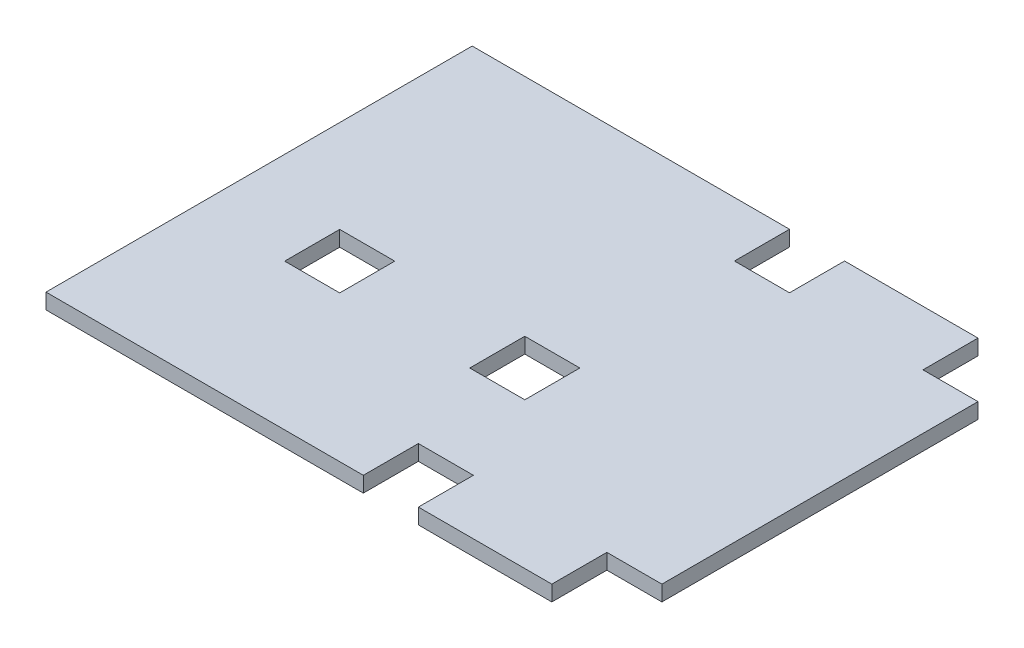
ISO-10303-21;
HEADER;
FILE_DESCRIPTION(('STEP AP214'),'2;1');
FILE_NAME('part.step','',(''),(''),'','','');
FILE_SCHEMA(('AUTOMOTIVE_DESIGN { 1 0 10303 214 1 1 1 1 }'));
ENDSEC;
DATA;
#1=APPLICATION_CONTEXT('core data for automotive mechanical design processes');
#2=APPLICATION_PROTOCOL_DEFINITION('international standard','automotive_design',2000,#1);
#3=PRODUCT_CONTEXT('',#1,'mechanical');
#4=PRODUCT('Part','Part','',(#3));
#5=PRODUCT_RELATED_PRODUCT_CATEGORY('part','',(#4));
#6=PRODUCT_DEFINITION_FORMATION('','',#4);
#7=PRODUCT_DEFINITION_CONTEXT('part definition',#1,'design');
#8=PRODUCT_DEFINITION('design','',#6,#7);
#9=PRODUCT_DEFINITION_SHAPE('','',#8);
#10=(LENGTH_UNIT() NAMED_UNIT(*) SI_UNIT(.MILLI.,.METRE.));
#11=(NAMED_UNIT(*) PLANE_ANGLE_UNIT() SI_UNIT($,.RADIAN.));
#12=(NAMED_UNIT(*) SI_UNIT($,.STERADIAN.) SOLID_ANGLE_UNIT());
#13=UNCERTAINTY_MEASURE_WITH_UNIT(LENGTH_MEASURE(1.E-05),#10,'distance_accuracy_value','');
#14=(GEOMETRIC_REPRESENTATION_CONTEXT(3) GLOBAL_UNCERTAINTY_ASSIGNED_CONTEXT((#13)) GLOBAL_UNIT_ASSIGNED_CONTEXT((#10,
#11,#12)) REPRESENTATION_CONTEXT('',''));
#15=CARTESIAN_POINT('',(0.,0.,0.));
#16=DIRECTION('',(0.,0.,1.));
#17=DIRECTION('',(1.,0.,0.));
#18=AXIS2_PLACEMENT_3D('',#15,#16,#17);
#19=CARTESIAN_POINT('',(-192.3,6.35,2.36168017295816E-13));
#20=DIRECTION('',(1.,0.,0.));
#21=DIRECTION('',(0.,0.,-1.));
#22=AXIS2_PLACEMENT_3D('',#19,#20,#21);
#23=PLANE('',#22);
#24=DIRECTION('',(0.,0.,1.));
#25=VECTOR('',#24,1.);
#26=CARTESIAN_POINT('',(-192.3,0.,2.36168017295816E-13));
#27=LINE('',#26,#25);
#28=CARTESIAN_POINT('',(-192.3,0.,92.4));
#29=VERTEX_POINT('',#28);
#30=CARTESIAN_POINT('',(-192.3,0.,115.));
#31=VERTEX_POINT('',#30);
#32=EDGE_CURVE('E289',#29,#31,#27,.T.);
#33=ORIENTED_EDGE('',*,*,#32,.F.);
#34=DIRECTION('',(0.,-1.,0.));
#35=VECTOR('',#34,1.);
#36=CARTESIAN_POINT('',(-192.3,6.35,92.4));
#37=LINE('',#36,#35);
#38=CARTESIAN_POINT('',(-192.3,6.35,92.4));
#39=VERTEX_POINT('',#38);
#40=EDGE_CURVE('E11',#39,#29,#37,.T.);
#41=ORIENTED_EDGE('',*,*,#40,.F.);
#42=DIRECTION('',(0.,0.,1.));
#43=VECTOR('',#42,1.);
#44=CARTESIAN_POINT('',(-192.3,6.35,2.36168017295816E-13));
#45=LINE('',#44,#43);
#46=CARTESIAN_POINT('',(-192.3,6.35,115.));
#47=VERTEX_POINT('',#46);
#48=EDGE_CURVE('E226',#39,#47,#45,.T.);
#49=ORIENTED_EDGE('',*,*,#48,.T.);
#50=DIRECTION('',(0.,-1.,0.));
#51=VECTOR('',#50,1.);
#52=CARTESIAN_POINT('',(-192.3,6.35,115.));
#53=LINE('',#52,#51);
#54=EDGE_CURVE('E140',#47,#31,#53,.T.);
#55=ORIENTED_EDGE('',*,*,#54,.T.);
#56=EDGE_LOOP('',(#33,#41,#49,#55));
#57=FACE_BOUND('',#56,.T.);
#58=ADVANCED_FACE('F38',(#57),#23,.T.);
#59=CARTESIAN_POINT('',(0.,6.35,92.4));
#60=DIRECTION('',(0.,0.,1.));
#61=DIRECTION('',(1.,0.,0.));
#62=AXIS2_PLACEMENT_3D('',#59,#60,#61);
#63=PLANE('',#62);
#64=DIRECTION('',(-1.,0.,0.));
#65=VECTOR('',#64,1.);
#66=CARTESIAN_POINT('',(0.,0.,92.4));
#67=LINE('',#66,#65);
#68=CARTESIAN_POINT('',(-169.7,0.,92.4));
#69=VERTEX_POINT('',#68);
#70=EDGE_CURVE('E216',#69,#29,#67,.T.);
#71=ORIENTED_EDGE('',*,*,#70,.F.);
#72=DIRECTION('',(0.,-1.,0.));
#73=VECTOR('',#72,1.);
#74=CARTESIAN_POINT('',(-169.7,6.35,92.4));
#75=LINE('',#74,#73);
#76=CARTESIAN_POINT('',(-169.7,6.35,92.4));
#77=VERTEX_POINT('',#76);
#78=EDGE_CURVE('E48',#77,#69,#75,.T.);
#79=ORIENTED_EDGE('',*,*,#78,.F.);
#80=DIRECTION('',(-1.,0.,0.));
#81=VECTOR('',#80,1.);
#82=CARTESIAN_POINT('',(0.,6.35,92.4));
#83=LINE('',#82,#81);
#84=EDGE_CURVE('E214',#77,#39,#83,.T.);
#85=ORIENTED_EDGE('',*,*,#84,.T.);
#86=ORIENTED_EDGE('',*,*,#40,.T.);
#87=EDGE_LOOP('',(#71,#79,#85,#86));
#88=FACE_BOUND('',#87,.T.);
#89=ADVANCED_FACE('F212',(#88),#63,.T.);
#90=CARTESIAN_POINT('',(-169.7,6.35,0.));
#91=DIRECTION('',(1.,0.,0.));
#92=DIRECTION('',(0.,0.,-1.));
#93=AXIS2_PLACEMENT_3D('',#90,#91,#92);
#94=PLANE('',#93);
#95=DIRECTION('',(0.,0.,1.));
#96=VECTOR('',#95,1.);
#97=CARTESIAN_POINT('',(-169.7,0.,0.));
#98=LINE('',#97,#96);
#99=CARTESIAN_POINT('',(-169.7,0.,115.));
#100=VERTEX_POINT('',#99);
#101=EDGE_CURVE('E292',#69,#100,#98,.T.);
#102=ORIENTED_EDGE('',*,*,#101,.T.);
#103=DIRECTION('',(0.,-1.,0.));
#104=VECTOR('',#103,1.);
#105=CARTESIAN_POINT('',(-169.7,6.35,115.));
#106=LINE('',#105,#104);
#107=CARTESIAN_POINT('',(-169.7,6.35,115.));
#108=VERTEX_POINT('',#107);
#109=EDGE_CURVE('E219',#108,#100,#106,.T.);
#110=ORIENTED_EDGE('',*,*,#109,.F.);
#111=DIRECTION('',(0.,0.,1.));
#112=VECTOR('',#111,1.);
#113=CARTESIAN_POINT('',(-169.7,6.35,0.));
#114=LINE('',#113,#112);
#115=EDGE_CURVE('E222',#77,#108,#114,.T.);
#116=ORIENTED_EDGE('',*,*,#115,.F.);
#117=ORIENTED_EDGE('',*,*,#78,.T.);
#118=EDGE_LOOP('',(#102,#110,#116,#117));
#119=FACE_BOUND('',#118,.T.);
#120=ADVANCED_FACE('F223',(#119),#94,.F.);
#121=CARTESIAN_POINT('',(-100.,6.35,0.));
#122=DIRECTION('',(1.,0.,0.));
#123=DIRECTION('',(0.,0.,-1.));
#124=AXIS2_PLACEMENT_3D('',#121,#122,#123);
#125=PLANE('',#124);
#126=DIRECTION('',(0.,0.,1.));
#127=VECTOR('',#126,1.);
#128=CARTESIAN_POINT('',(-100.,0.,0.));
#129=LINE('',#128,#127);
#130=CARTESIAN_POINT('',(-100.,0.,0.));
#131=VERTEX_POINT('',#130);
#132=CARTESIAN_POINT('',(-100.,0.,22.6));
#133=VERTEX_POINT('',#132);
#134=EDGE_CURVE('E245',#131,#133,#129,.T.);
#135=ORIENTED_EDGE('',*,*,#134,.F.);
#136=DIRECTION('',(0.,-1.,0.));
#137=VECTOR('',#136,1.);
#138=CARTESIAN_POINT('',(-100.,6.35,0.));
#139=LINE('',#138,#137);
#140=CARTESIAN_POINT('',(-100.,6.35,0.));
#141=VERTEX_POINT('',#140);
#142=EDGE_CURVE('E297',#141,#131,#139,.T.);
#143=ORIENTED_EDGE('',*,*,#142,.F.);
#144=DIRECTION('',(0.,0.,1.));
#145=VECTOR('',#144,1.);
#146=CARTESIAN_POINT('',(-100.,6.35,0.));
#147=LINE('',#146,#145);
#148=CARTESIAN_POINT('',(-100.,6.35,22.6));
#149=VERTEX_POINT('',#148);
#150=EDGE_CURVE('E358',#141,#149,#147,.T.);
#151=ORIENTED_EDGE('',*,*,#150,.T.);
#152=DIRECTION('',(0.,-1.,0.));
#153=VECTOR('',#152,1.);
#154=CARTESIAN_POINT('',(-100.,6.35,22.6));
#155=LINE('',#154,#153);
#156=EDGE_CURVE('E299',#149,#133,#155,.T.);
#157=ORIENTED_EDGE('',*,*,#156,.T.);
#158=EDGE_LOOP('',(#135,#143,#151,#157));
#159=FACE_BOUND('',#158,.T.);
#160=ADVANCED_FACE('F412',(#159),#125,.T.);
#161=CARTESIAN_POINT('',(0.,6.35,0.));
#162=DIRECTION('',(0.,0.,-1.));
#163=DIRECTION('',(-1.,0.,0.));
#164=AXIS2_PLACEMENT_3D('',#161,#162,#163);
#165=PLANE('',#164);
#166=DIRECTION('',(1.,0.,0.));
#167=VECTOR('',#166,1.);
#168=CARTESIAN_POINT('',(0.,0.,0.));
#169=LINE('',#168,#167);
#170=CARTESIAN_POINT('',(-230.3,0.,0.));
#171=VERTEX_POINT('',#170);
#172=EDGE_CURVE('E248',#171,#131,#169,.T.);
#173=ORIENTED_EDGE('',*,*,#172,.F.);
#174=DIRECTION('',(0.,-1.,0.));
#175=VECTOR('',#174,1.);
#176=CARTESIAN_POINT('',(-230.3,6.35,0.));
#177=LINE('',#176,#175);
#178=CARTESIAN_POINT('',(-230.3,6.35,0.));
#179=VERTEX_POINT('',#178);
#180=EDGE_CURVE('E330',#179,#171,#177,.T.);
#181=ORIENTED_EDGE('',*,*,#180,.F.);
#182=DIRECTION('',(1.,0.,0.));
#183=VECTOR('',#182,1.);
#184=CARTESIAN_POINT('',(0.,6.35,0.));
#185=LINE('',#184,#183);
#186=EDGE_CURVE('E362',#179,#141,#185,.T.);
#187=ORIENTED_EDGE('',*,*,#186,.T.);
#188=ORIENTED_EDGE('',*,*,#142,.T.);
#189=EDGE_LOOP('',(#173,#181,#187,#188));
#190=FACE_BOUND('',#189,.T.);
#191=ADVANCED_FACE('F415',(#190),#165,.T.);
#192=CARTESIAN_POINT('',(-230.3,6.35,0.));
#193=DIRECTION('',(1.,0.,0.));
#194=DIRECTION('',(0.,0.,-1.));
#195=AXIS2_PLACEMENT_3D('',#192,#193,#194);
#196=PLANE('',#195);
#197=DIRECTION('',(0.,0.,1.));
#198=VECTOR('',#197,1.);
#199=CARTESIAN_POINT('',(-230.3,0.,0.));
#200=LINE('',#199,#198);
#201=CARTESIAN_POINT('',(-230.3,0.,175.));
#202=VERTEX_POINT('',#201);
#203=EDGE_CURVE('E251',#171,#202,#200,.T.);
#204=ORIENTED_EDGE('',*,*,#203,.T.);
#205=DIRECTION('',(0.,-1.,0.));
#206=VECTOR('',#205,1.);
#207=CARTESIAN_POINT('',(-230.3,6.35,175.));
#208=LINE('',#207,#206);
#209=CARTESIAN_POINT('',(-230.3,6.35,175.));
#210=VERTEX_POINT('',#209);
#211=EDGE_CURVE('E327',#210,#202,#208,.T.);
#212=ORIENTED_EDGE('',*,*,#211,.F.);
#213=DIRECTION('',(0.,0.,1.));
#214=VECTOR('',#213,1.);
#215=CARTESIAN_POINT('',(-230.3,6.35,0.));
#216=LINE('',#215,#214);
#217=EDGE_CURVE('E369',#179,#210,#216,.T.);
#218=ORIENTED_EDGE('',*,*,#217,.F.);
#219=ORIENTED_EDGE('',*,*,#180,.T.);
#220=EDGE_LOOP('',(#204,#212,#218,#219));
#221=FACE_BOUND('',#220,.T.);
#222=ADVANCED_FACE('F421',(#221),#196,.F.);
#223=CARTESIAN_POINT('',(0.,6.35,175.));
#224=DIRECTION('',(0.,0.,-1.));
#225=DIRECTION('',(-1.,0.,0.));
#226=AXIS2_PLACEMENT_3D('',#223,#224,#225);
#227=PLANE('',#226);
#228=DIRECTION('',(1.,0.,0.));
#229=VECTOR('',#228,1.);
#230=CARTESIAN_POINT('',(0.,0.,175.));
#231=LINE('',#230,#229);
#232=CARTESIAN_POINT('',(-100.,0.,175.));
#233=VERTEX_POINT('',#232);
#234=EDGE_CURVE('E255',#202,#233,#231,.T.);
#235=ORIENTED_EDGE('',*,*,#234,.T.);
#236=DIRECTION('',(0.,-1.,0.));
#237=VECTOR('',#236,1.);
#238=CARTESIAN_POINT('',(-100.,6.35,175.));
#239=LINE('',#238,#237);
#240=CARTESIAN_POINT('',(-100.,6.35,175.));
#241=VERTEX_POINT('',#240);
#242=EDGE_CURVE('E325',#241,#233,#239,.T.);
#243=ORIENTED_EDGE('',*,*,#242,.F.);
#244=DIRECTION('',(1.,0.,0.));
#245=VECTOR('',#244,1.);
#246=CARTESIAN_POINT('',(0.,6.35,175.));
#247=LINE('',#246,#245);
#248=EDGE_CURVE('E373',#210,#241,#247,.T.);
#249=ORIENTED_EDGE('',*,*,#248,.F.);
#250=ORIENTED_EDGE('',*,*,#211,.T.);
#251=EDGE_LOOP('',(#235,#243,#249,#250));
#252=FACE_BOUND('',#251,.T.);
#253=ADVANCED_FACE('F424',(#252),#227,.F.);
#254=CARTESIAN_POINT('',(-100.,6.35,0.));
#255=DIRECTION('',(1.,0.,0.));
#256=DIRECTION('',(0.,0.,-1.));
#257=AXIS2_PLACEMENT_3D('',#254,#255,#256);
#258=PLANE('',#257);
#259=DIRECTION('',(0.,0.,1.));
#260=VECTOR('',#259,1.);
#261=CARTESIAN_POINT('',(-100.,0.,0.));
#262=LINE('',#261,#260);
#263=CARTESIAN_POINT('',(-100.,0.,152.4));
#264=VERTEX_POINT('',#263);
#265=EDGE_CURVE('E258',#264,#233,#262,.T.);
#266=ORIENTED_EDGE('',*,*,#265,.F.);
#267=DIRECTION('',(0.,-1.,0.));
#268=VECTOR('',#267,1.);
#269=CARTESIAN_POINT('',(-100.,6.35,152.4));
#270=LINE('',#269,#268);
#271=CARTESIAN_POINT('',(-100.,6.35,152.4));
#272=VERTEX_POINT('',#271);
#273=EDGE_CURVE('E323',#272,#264,#270,.T.);
#274=ORIENTED_EDGE('',*,*,#273,.F.);
#275=DIRECTION('',(0.,0.,1.));
#276=VECTOR('',#275,1.);
#277=CARTESIAN_POINT('',(-100.,6.35,0.));
#278=LINE('',#277,#276);
#279=EDGE_CURVE('E375',#272,#241,#278,.T.);
#280=ORIENTED_EDGE('',*,*,#279,.T.);
#281=ORIENTED_EDGE('',*,*,#242,.T.);
#282=EDGE_LOOP('',(#266,#274,#280,#281));
#283=FACE_BOUND('',#282,.T.);
#284=ADVANCED_FACE('F427',(#283),#258,.T.);
#285=CARTESIAN_POINT('',(0.,6.35,152.4));
#286=DIRECTION('',(0.,0.,1.));
#287=DIRECTION('',(1.,0.,0.));
#288=AXIS2_PLACEMENT_3D('',#285,#286,#287);
#289=PLANE('',#288);
#290=DIRECTION('',(-1.,0.,0.));
#291=VECTOR('',#290,1.);
#292=CARTESIAN_POINT('',(0.,0.,152.4));
#293=LINE('',#292,#291);
#294=CARTESIAN_POINT('',(-77.4,0.,152.4));
#295=VERTEX_POINT('',#294);
#296=EDGE_CURVE('E262',#295,#264,#293,.T.);
#297=ORIENTED_EDGE('',*,*,#296,.F.);
#298=DIRECTION('',(0.,-1.,0.));
#299=VECTOR('',#298,1.);
#300=CARTESIAN_POINT('',(-77.4,6.35,152.4));
#301=LINE('',#300,#299);
#302=CARTESIAN_POINT('',(-77.4,6.35,152.4));
#303=VERTEX_POINT('',#302);
#304=EDGE_CURVE('E321',#303,#295,#301,.T.);
#305=ORIENTED_EDGE('',*,*,#304,.F.);
#306=DIRECTION('',(-1.,0.,0.));
#307=VECTOR('',#306,1.);
#308=CARTESIAN_POINT('',(0.,6.35,152.4));
#309=LINE('',#308,#307);
#310=EDGE_CURVE('E379',#303,#272,#309,.T.);
#311=ORIENTED_EDGE('',*,*,#310,.T.);
#312=ORIENTED_EDGE('',*,*,#273,.T.);
#313=EDGE_LOOP('',(#297,#305,#311,#312));
#314=FACE_BOUND('',#313,.T.);
#315=ADVANCED_FACE('F431',(#314),#289,.T.);
#316=CARTESIAN_POINT('',(-77.4,6.35,0.));
#317=DIRECTION('',(1.,0.,0.));
#318=DIRECTION('',(0.,0.,-1.));
#319=AXIS2_PLACEMENT_3D('',#316,#317,#318);
#320=PLANE('',#319);
#321=DIRECTION('',(0.,0.,1.));
#322=VECTOR('',#321,1.);
#323=CARTESIAN_POINT('',(-77.4,0.,0.));
#324=LINE('',#323,#322);
#325=CARTESIAN_POINT('',(-77.4,0.,175.));
#326=VERTEX_POINT('',#325);
#327=EDGE_CURVE('E265',#295,#326,#324,.T.);
#328=ORIENTED_EDGE('',*,*,#327,.T.);
#329=DIRECTION('',(0.,-1.,0.));
#330=VECTOR('',#329,1.);
#331=CARTESIAN_POINT('',(-77.4,6.35,175.));
#332=LINE('',#331,#330);
#333=CARTESIAN_POINT('',(-77.4,6.35,175.));
#334=VERTEX_POINT('',#333);
#335=EDGE_CURVE('E318',#334,#326,#332,.T.);
#336=ORIENTED_EDGE('',*,*,#335,.F.);
#337=DIRECTION('',(0.,0.,1.));
#338=VECTOR('',#337,1.);
#339=CARTESIAN_POINT('',(-77.4,6.35,0.));
#340=LINE('',#339,#338);
#341=EDGE_CURVE('E382',#303,#334,#340,.T.);
#342=ORIENTED_EDGE('',*,*,#341,.F.);
#343=ORIENTED_EDGE('',*,*,#304,.T.);
#344=EDGE_LOOP('',(#328,#336,#342,#343));
#345=FACE_BOUND('',#344,.T.);
#346=ADVANCED_FACE('F436',(#345),#320,.F.);
#347=CARTESIAN_POINT('',(-22.6,0.,175.));
#348=VERTEX_POINT('',#347);
#349=EDGE_CURVE('E259',#326,#348,#231,.T.);
#350=ORIENTED_EDGE('',*,*,#349,.T.);
#351=DIRECTION('',(0.,-1.,0.));
#352=VECTOR('',#351,1.);
#353=CARTESIAN_POINT('',(-22.6,6.35,175.));
#354=LINE('',#353,#352);
#355=CARTESIAN_POINT('',(-22.6,6.35,175.));
#356=VERTEX_POINT('',#355);
#357=EDGE_CURVE('E316',#356,#348,#354,.T.);
#358=ORIENTED_EDGE('',*,*,#357,.F.);
#359=EDGE_CURVE('E376',#334,#356,#247,.T.);
#360=ORIENTED_EDGE('',*,*,#359,.F.);
#361=ORIENTED_EDGE('',*,*,#335,.T.);
#362=EDGE_LOOP('',(#350,#358,#360,#361));
#363=FACE_BOUND('',#362,.T.);
#364=ADVANCED_FACE('F442',(#363),#227,.F.);
#365=CARTESIAN_POINT('',(-22.6,6.35,0.));
#366=DIRECTION('',(1.,0.,0.));
#367=DIRECTION('',(0.,0.,-1.));
#368=AXIS2_PLACEMENT_3D('',#365,#366,#367);
#369=PLANE('',#368);
#370=DIRECTION('',(0.,0.,1.));
#371=VECTOR('',#370,1.);
#372=CARTESIAN_POINT('',(-22.6,0.,0.));
#373=LINE('',#372,#371);
#374=CARTESIAN_POINT('',(-22.6,0.,152.4));
#375=VERTEX_POINT('',#374);
#376=EDGE_CURVE('E268',#375,#348,#373,.T.);
#377=ORIENTED_EDGE('',*,*,#376,.F.);
#378=DIRECTION('',(0.,-1.,0.));
#379=VECTOR('',#378,1.);
#380=CARTESIAN_POINT('',(-22.6,6.35,152.4));
#381=LINE('',#380,#379);
#382=CARTESIAN_POINT('',(-22.6,6.35,152.4));
#383=VERTEX_POINT('',#382);
#384=EDGE_CURVE('E314',#383,#375,#381,.T.);
#385=ORIENTED_EDGE('',*,*,#384,.F.);
#386=DIRECTION('',(0.,0.,1.));
#387=VECTOR('',#386,1.);
#388=CARTESIAN_POINT('',(-22.6,6.35,0.));
#389=LINE('',#388,#387);
#390=EDGE_CURVE('E385',#383,#356,#389,.T.);
#391=ORIENTED_EDGE('',*,*,#390,.T.);
#392=ORIENTED_EDGE('',*,*,#357,.T.);
#393=EDGE_LOOP('',(#377,#385,#391,#392));
#394=FACE_BOUND('',#393,.T.);
#395=ADVANCED_FACE('F445',(#394),#369,.T.);
#396=CARTESIAN_POINT('',(0.,6.35,152.4));
#397=DIRECTION('',(0.,0.,1.));
#398=DIRECTION('',(1.,0.,0.));
#399=AXIS2_PLACEMENT_3D('',#396,#397,#398);
#400=PLANE('',#399);
#401=DIRECTION('',(-1.,0.,0.));
#402=VECTOR('',#401,1.);
#403=CARTESIAN_POINT('',(0.,0.,152.4));
#404=LINE('',#403,#402);
#405=CARTESIAN_POINT('',(0.,0.,152.4));
#406=VERTEX_POINT('',#405);
#407=EDGE_CURVE('E271',#406,#375,#404,.T.);
#408=ORIENTED_EDGE('',*,*,#407,.F.);
#409=DIRECTION('',(0.,-1.,0.));
#410=VECTOR('',#409,1.);
#411=CARTESIAN_POINT('',(0.,6.35,152.4));
#412=LINE('',#411,#410);
#413=CARTESIAN_POINT('',(0.,6.35,152.4));
#414=VERTEX_POINT('',#413);
#415=EDGE_CURVE('E312',#414,#406,#412,.T.);
#416=ORIENTED_EDGE('',*,*,#415,.F.);
#417=DIRECTION('',(-1.,0.,0.));
#418=VECTOR('',#417,1.);
#419=CARTESIAN_POINT('',(0.,6.35,152.4));
#420=LINE('',#419,#418);
#421=EDGE_CURVE('E388',#414,#383,#420,.T.);
#422=ORIENTED_EDGE('',*,*,#421,.T.);
#423=ORIENTED_EDGE('',*,*,#384,.T.);
#424=EDGE_LOOP('',(#408,#416,#422,#423));
#425=FACE_BOUND('',#424,.T.);
#426=ADVANCED_FACE('F448',(#425),#400,.T.);
#427=CARTESIAN_POINT('',(0.,6.35,0.));
#428=DIRECTION('',(1.,0.,0.));
#429=DIRECTION('',(0.,0.,-1.));
#430=AXIS2_PLACEMENT_3D('',#427,#428,#429);
#431=PLANE('',#430);
#432=DIRECTION('',(0.,0.,1.));
#433=VECTOR('',#432,1.);
#434=CARTESIAN_POINT('',(0.,0.,0.));
#435=LINE('',#434,#433);
#436=CARTESIAN_POINT('',(0.,0.,22.6));
#437=VERTEX_POINT('',#436);
#438=EDGE_CURVE('E274',#437,#406,#435,.T.);
#439=ORIENTED_EDGE('',*,*,#438,.F.);
#440=DIRECTION('',(0.,-1.,0.));
#441=VECTOR('',#440,1.);
#442=CARTESIAN_POINT('',(0.,6.35,22.6));
#443=LINE('',#442,#441);
#444=CARTESIAN_POINT('',(0.,6.35,22.6));
#445=VERTEX_POINT('',#444);
#446=EDGE_CURVE('E310',#445,#437,#443,.T.);
#447=ORIENTED_EDGE('',*,*,#446,.F.);
#448=DIRECTION('',(0.,0.,1.));
#449=VECTOR('',#448,1.);
#450=CARTESIAN_POINT('',(0.,6.35,0.));
#451=LINE('',#450,#449);
#452=EDGE_CURVE('E391',#445,#414,#451,.T.);
#453=ORIENTED_EDGE('',*,*,#452,.T.);
#454=ORIENTED_EDGE('',*,*,#415,.T.);
#455=EDGE_LOOP('',(#439,#447,#453,#454));
#456=FACE_BOUND('',#455,.T.);
#457=ADVANCED_FACE('F452',(#456),#431,.T.);
#458=CARTESIAN_POINT('',(0.,6.35,22.6));
#459=DIRECTION('',(0.,0.,1.));
#460=DIRECTION('',(1.,0.,0.));
#461=AXIS2_PLACEMENT_3D('',#458,#459,#460);
#462=PLANE('',#461);
#463=DIRECTION('',(-1.,0.,0.));
#464=VECTOR('',#463,1.);
#465=CARTESIAN_POINT('',(0.,0.,22.6));
#466=LINE('',#465,#464);
#467=CARTESIAN_POINT('',(-22.6,0.,22.6));
#468=VERTEX_POINT('',#467);
#469=EDGE_CURVE('E277',#437,#468,#466,.T.);
#470=ORIENTED_EDGE('',*,*,#469,.T.);
#471=DIRECTION('',(0.,-1.,0.));
#472=VECTOR('',#471,1.);
#473=CARTESIAN_POINT('',(-22.6,6.35,22.6));
#474=LINE('',#473,#472);
#475=CARTESIAN_POINT('',(-22.6,6.35,22.6));
#476=VERTEX_POINT('',#475);
#477=EDGE_CURVE('E308',#476,#468,#474,.T.);
#478=ORIENTED_EDGE('',*,*,#477,.F.);
#479=DIRECTION('',(-1.,0.,0.));
#480=VECTOR('',#479,1.);
#481=CARTESIAN_POINT('',(0.,6.35,22.6));
#482=LINE('',#481,#480);
#483=EDGE_CURVE('E394',#445,#476,#482,.T.);
#484=ORIENTED_EDGE('',*,*,#483,.F.);
#485=ORIENTED_EDGE('',*,*,#446,.T.);
#486=EDGE_LOOP('',(#470,#478,#484,#485));
#487=FACE_BOUND('',#486,.T.);
#488=ADVANCED_FACE('F457',(#487),#462,.F.);
#489=CARTESIAN_POINT('',(-22.6,6.35,0.));
#490=DIRECTION('',(1.,0.,0.));
#491=DIRECTION('',(0.,0.,-1.));
#492=AXIS2_PLACEMENT_3D('',#489,#490,#491);
#493=PLANE('',#492);
#494=DIRECTION('',(0.,0.,1.));
#495=VECTOR('',#494,1.);
#496=CARTESIAN_POINT('',(-22.6,0.,0.));
#497=LINE('',#496,#495);
#498=CARTESIAN_POINT('',(-22.6,0.,0.));
#499=VERTEX_POINT('',#498);
#500=EDGE_CURVE('E280',#499,#468,#497,.T.);
#501=ORIENTED_EDGE('',*,*,#500,.F.);
#502=DIRECTION('',(0.,-1.,0.));
#503=VECTOR('',#502,1.);
#504=CARTESIAN_POINT('',(-22.6,6.35,0.));
#505=LINE('',#504,#503);
#506=CARTESIAN_POINT('',(-22.6,6.35,0.));
#507=VERTEX_POINT('',#506);
#508=EDGE_CURVE('E306',#507,#499,#505,.T.);
#509=ORIENTED_EDGE('',*,*,#508,.F.);
#510=DIRECTION('',(0.,0.,1.));
#511=VECTOR('',#510,1.);
#512=CARTESIAN_POINT('',(-22.6,6.35,0.));
#513=LINE('',#512,#511);
#514=EDGE_CURVE('E396',#507,#476,#513,.T.);
#515=ORIENTED_EDGE('',*,*,#514,.T.);
#516=ORIENTED_EDGE('',*,*,#477,.T.);
#517=EDGE_LOOP('',(#501,#509,#515,#516));
#518=FACE_BOUND('',#517,.T.);
#519=ADVANCED_FACE('F469',(#518),#493,.T.);
#520=CARTESIAN_POINT('',(-77.4,0.,0.));
#521=VERTEX_POINT('',#520);
#522=EDGE_CURVE('E252',#521,#499,#169,.T.);
#523=ORIENTED_EDGE('',*,*,#522,.F.);
#524=DIRECTION('',(0.,-1.,0.));
#525=VECTOR('',#524,1.);
#526=CARTESIAN_POINT('',(-77.4,6.35,0.));
#527=LINE('',#526,#525);
#528=CARTESIAN_POINT('',(-77.4,6.35,0.));
#529=VERTEX_POINT('',#528);
#530=EDGE_CURVE('E304',#529,#521,#527,.T.);
#531=ORIENTED_EDGE('',*,*,#530,.F.);
#532=EDGE_CURVE('E370',#529,#507,#185,.T.);
#533=ORIENTED_EDGE('',*,*,#532,.T.);
#534=ORIENTED_EDGE('',*,*,#508,.T.);
#535=EDGE_LOOP('',(#523,#531,#533,#534));
#536=FACE_BOUND('',#535,.T.);
#537=ADVANCED_FACE('F463',(#536),#165,.T.);
#538=CARTESIAN_POINT('',(-77.4,6.35,0.));
#539=DIRECTION('',(1.,0.,0.));
#540=DIRECTION('',(0.,0.,-1.));
#541=AXIS2_PLACEMENT_3D('',#538,#539,#540);
#542=PLANE('',#541);
#543=DIRECTION('',(0.,0.,1.));
#544=VECTOR('',#543,1.);
#545=CARTESIAN_POINT('',(-77.4,0.,0.));
#546=LINE('',#545,#544);
#547=CARTESIAN_POINT('',(-77.4,0.,22.6));
#548=VERTEX_POINT('',#547);
#549=EDGE_CURVE('E283',#521,#548,#546,.T.);
#550=ORIENTED_EDGE('',*,*,#549,.T.);
#551=DIRECTION('',(0.,-1.,0.));
#552=VECTOR('',#551,1.);
#553=CARTESIAN_POINT('',(-77.4,6.35,22.6));
#554=LINE('',#553,#552);
#555=CARTESIAN_POINT('',(-77.4,6.35,22.6));
#556=VERTEX_POINT('',#555);
#557=EDGE_CURVE('E301',#556,#548,#554,.T.);
#558=ORIENTED_EDGE('',*,*,#557,.F.);
#559=DIRECTION('',(0.,0.,1.));
#560=VECTOR('',#559,1.);
#561=CARTESIAN_POINT('',(-77.4,6.35,0.));
#562=LINE('',#561,#560);
#563=EDGE_CURVE('E399',#529,#556,#562,.T.);
#564=ORIENTED_EDGE('',*,*,#563,.F.);
#565=ORIENTED_EDGE('',*,*,#530,.T.);
#566=EDGE_LOOP('',(#550,#558,#564,#565));
#567=FACE_BOUND('',#566,.T.);
#568=ADVANCED_FACE('F468',(#567),#542,.F.);
#569=CARTESIAN_POINT('',(-116.3,6.35,0.));
#570=DIRECTION('',(1.,0.,0.));
#571=DIRECTION('',(0.,0.,-1.));
#572=AXIS2_PLACEMENT_3D('',#569,#570,#571);
#573=PLANE('',#572);
#574=DIRECTION('',(0.,0.,1.));
#575=VECTOR('',#574,1.);
#576=CARTESIAN_POINT('',(-116.3,0.,0.));
#577=LINE('',#576,#575);
#578=CARTESIAN_POINT('',(-116.3,0.,92.4));
#579=VERTEX_POINT('',#578);
#580=CARTESIAN_POINT('',(-116.3,0.,115.));
#581=VERTEX_POINT('',#580);
#582=EDGE_CURVE('E234',#579,#581,#577,.T.);
#583=ORIENTED_EDGE('',*,*,#582,.F.);
#584=DIRECTION('',(0.,-1.,0.));
#585=VECTOR('',#584,1.);
#586=CARTESIAN_POINT('',(-116.3,6.35,92.4));
#587=LINE('',#586,#585);
#588=CARTESIAN_POINT('',(-116.3,6.35,92.4));
#589=VERTEX_POINT('',#588);
#590=EDGE_CURVE('E42',#589,#579,#587,.T.);
#591=ORIENTED_EDGE('',*,*,#590,.F.);
#592=DIRECTION('',(0.,0.,1.));
#593=VECTOR('',#592,1.);
#594=CARTESIAN_POINT('',(-116.3,6.35,0.));
#595=LINE('',#594,#593);
#596=CARTESIAN_POINT('',(-116.3,6.35,115.));
#597=VERTEX_POINT('',#596);
#598=EDGE_CURVE('E295',#589,#597,#595,.T.);
#599=ORIENTED_EDGE('',*,*,#598,.T.);
#600=DIRECTION('',(0.,-1.,0.));
#601=VECTOR('',#600,1.);
#602=CARTESIAN_POINT('',(-116.3,6.35,115.));
#603=LINE('',#602,#601);
#604=EDGE_CURVE('E233',#597,#581,#603,.T.);
#605=ORIENTED_EDGE('',*,*,#604,.T.);
#606=EDGE_LOOP('',(#583,#591,#599,#605));
#607=FACE_BOUND('',#606,.T.);
#608=ADVANCED_FACE('F40',(#607),#573,.T.);
#609=CARTESIAN_POINT('',(1.13478548092217E-13,6.35,92.3999999999999));
#610=DIRECTION('',(0.,0.,1.));
#611=DIRECTION('',(1.,0.,0.));
#612=AXIS2_PLACEMENT_3D('',#609,#610,#611);
#613=PLANE('',#612);
#614=DIRECTION('',(-1.,0.,0.));
#615=VECTOR('',#614,1.);
#616=CARTESIAN_POINT('',(1.13478548092217E-13,0.,92.3999999999999));
#617=LINE('',#616,#615);
#618=CARTESIAN_POINT('',(-93.6999999999999,0.,92.4));
#619=VERTEX_POINT('',#618);
#620=EDGE_CURVE('E237',#619,#579,#617,.T.);
#621=ORIENTED_EDGE('',*,*,#620,.F.);
#622=DIRECTION('',(0.,-1.,0.));
#623=VECTOR('',#622,1.);
#624=CARTESIAN_POINT('',(-93.6999999999999,6.35,92.4));
#625=LINE('',#624,#623);
#626=CARTESIAN_POINT('',(-93.6999999999999,6.35,92.4));
#627=VERTEX_POINT('',#626);
#628=EDGE_CURVE('E336',#627,#619,#625,.T.);
#629=ORIENTED_EDGE('',*,*,#628,.F.);
#630=DIRECTION('',(-1.,0.,0.));
#631=VECTOR('',#630,1.);
#632=CARTESIAN_POINT('',(1.13478548092217E-13,6.35,92.3999999999999));
#633=LINE('',#632,#631);
#634=EDGE_CURVE('E345',#627,#589,#633,.T.);
#635=ORIENTED_EDGE('',*,*,#634,.T.);
#636=ORIENTED_EDGE('',*,*,#590,.T.);
#637=EDGE_LOOP('',(#621,#629,#635,#636));
#638=FACE_BOUND('',#637,.T.);
#639=ADVANCED_FACE('F343',(#638),#613,.T.);
#640=CARTESIAN_POINT('',(-93.6999999999999,6.35,0.));
#641=DIRECTION('',(1.,0.,0.));
#642=DIRECTION('',(0.,0.,-1.));
#643=AXIS2_PLACEMENT_3D('',#640,#641,#642);
#644=PLANE('',#643);
#645=DIRECTION('',(0.,0.,1.));
#646=VECTOR('',#645,1.);
#647=CARTESIAN_POINT('',(-93.6999999999999,0.,0.));
#648=LINE('',#647,#646);
#649=CARTESIAN_POINT('',(-93.6999999999999,0.,115.));
#650=VERTEX_POINT('',#649);
#651=EDGE_CURVE('E240',#619,#650,#648,.T.);
#652=ORIENTED_EDGE('',*,*,#651,.T.);
#653=DIRECTION('',(0.,-1.,0.));
#654=VECTOR('',#653,1.);
#655=CARTESIAN_POINT('',(-93.6999999999999,6.35,115.));
#656=LINE('',#655,#654);
#657=CARTESIAN_POINT('',(-93.6999999999999,6.35,115.));
#658=VERTEX_POINT('',#657);
#659=EDGE_CURVE('E334',#658,#650,#656,.T.);
#660=ORIENTED_EDGE('',*,*,#659,.F.);
#661=DIRECTION('',(0.,0.,1.));
#662=VECTOR('',#661,1.);
#663=CARTESIAN_POINT('',(-93.6999999999999,6.35,0.));
#664=LINE('',#663,#662);
#665=EDGE_CURVE('E359',#627,#658,#664,.T.);
#666=ORIENTED_EDGE('',*,*,#665,.F.);
#667=ORIENTED_EDGE('',*,*,#628,.T.);
#668=EDGE_LOOP('',(#652,#660,#666,#667));
#669=FACE_BOUND('',#668,.T.);
#670=ADVANCED_FACE('F352',(#669),#644,.F.);
#671=CARTESIAN_POINT('',(0.,6.35,22.5999999999999));
#672=DIRECTION('',(0.,0.,1.));
#673=DIRECTION('',(1.,0.,0.));
#674=AXIS2_PLACEMENT_3D('',#671,#672,#673);
#675=PLANE('',#674);
#676=DIRECTION('',(-1.,0.,0.));
#677=VECTOR('',#676,1.);
#678=CARTESIAN_POINT('',(0.,0.,22.5999999999999));
#679=LINE('',#678,#677);
#680=EDGE_CURVE('E286',#548,#133,#679,.T.);
#681=ORIENTED_EDGE('',*,*,#680,.T.);
#682=ORIENTED_EDGE('',*,*,#156,.F.);
#683=DIRECTION('',(-1.,0.,0.));
#684=VECTOR('',#683,1.);
#685=CARTESIAN_POINT('',(0.,6.35,22.5999999999999));
#686=LINE('',#685,#684);
#687=EDGE_CURVE('E228',#556,#149,#686,.T.);
#688=ORIENTED_EDGE('',*,*,#687,.F.);
#689=ORIENTED_EDGE('',*,*,#557,.T.);
#690=EDGE_LOOP('',(#681,#682,#688,#689));
#691=FACE_BOUND('',#690,.T.);
#692=ADVANCED_FACE('F409',(#691),#675,.F.);
#693=CARTESIAN_POINT('',(0.,6.35,115.));
#694=DIRECTION('',(0.,0.,1.));
#695=DIRECTION('',(1.,0.,0.));
#696=AXIS2_PLACEMENT_3D('',#693,#694,#695);
#697=PLANE('',#696);
#698=DIRECTION('',(-1.,0.,0.));
#699=VECTOR('',#698,1.);
#700=CARTESIAN_POINT('',(0.,0.,115.));
#701=LINE('',#700,#699);
#702=EDGE_CURVE('E242',#650,#581,#701,.T.);
#703=ORIENTED_EDGE('',*,*,#702,.T.);
#704=ORIENTED_EDGE('',*,*,#604,.F.);
#705=DIRECTION('',(-1.,0.,0.));
#706=VECTOR('',#705,1.);
#707=CARTESIAN_POINT('',(0.,6.35,115.));
#708=LINE('',#707,#706);
#709=EDGE_CURVE('E356',#658,#597,#708,.T.);
#710=ORIENTED_EDGE('',*,*,#709,.F.);
#711=ORIENTED_EDGE('',*,*,#659,.T.);
#712=EDGE_LOOP('',(#703,#704,#710,#711));
#713=FACE_BOUND('',#712,.T.);
#714=ADVANCED_FACE('F355',(#713),#697,.F.);
#715=CARTESIAN_POINT('',(0.,6.35,115.));
#716=DIRECTION('',(0.,0.,1.));
#717=DIRECTION('',(1.,0.,0.));
#718=AXIS2_PLACEMENT_3D('',#715,#716,#717);
#719=PLANE('',#718);
#720=DIRECTION('',(-1.,0.,0.));
#721=VECTOR('',#720,1.);
#722=CARTESIAN_POINT('',(0.,0.,115.));
#723=LINE('',#722,#721);
#724=EDGE_CURVE('E133',#100,#31,#723,.T.);
#725=ORIENTED_EDGE('',*,*,#724,.T.);
#726=ORIENTED_EDGE('',*,*,#54,.F.);
#727=DIRECTION('',(-1.,0.,0.));
#728=VECTOR('',#727,1.);
#729=CARTESIAN_POINT('',(0.,6.35,115.));
#730=LINE('',#729,#728);
#731=EDGE_CURVE('E57',#108,#47,#730,.T.);
#732=ORIENTED_EDGE('',*,*,#731,.F.);
#733=ORIENTED_EDGE('',*,*,#109,.T.);
#734=EDGE_LOOP('',(#725,#726,#732,#733));
#735=FACE_BOUND('',#734,.T.);
#736=ADVANCED_FACE('F502',(#735),#719,.F.);
#737=CARTESIAN_POINT('',(0.,6.35,0.));
#738=DIRECTION('',(0.,1.,0.));
#739=DIRECTION('',(0.,0.,1.));
#740=AXIS2_PLACEMENT_3D('',#737,#738,#739);
#741=PLANE('',#740);
#742=ORIENTED_EDGE('',*,*,#598,.F.);
#743=ORIENTED_EDGE('',*,*,#634,.F.);
#744=ORIENTED_EDGE('',*,*,#665,.T.);
#745=ORIENTED_EDGE('',*,*,#709,.T.);
#746=EDGE_LOOP('',(#742,#743,#744,#745));
#747=FACE_BOUND('',#746,.T.);
#748=ORIENTED_EDGE('',*,*,#150,.F.);
#749=ORIENTED_EDGE('',*,*,#186,.F.);
#750=ORIENTED_EDGE('',*,*,#217,.T.);
#751=ORIENTED_EDGE('',*,*,#248,.T.);
#752=ORIENTED_EDGE('',*,*,#279,.F.);
#753=ORIENTED_EDGE('',*,*,#310,.F.);
#754=ORIENTED_EDGE('',*,*,#341,.T.);
#755=ORIENTED_EDGE('',*,*,#359,.T.);
#756=ORIENTED_EDGE('',*,*,#390,.F.);
#757=ORIENTED_EDGE('',*,*,#421,.F.);
#758=ORIENTED_EDGE('',*,*,#452,.F.);
#759=ORIENTED_EDGE('',*,*,#483,.T.);
#760=ORIENTED_EDGE('',*,*,#514,.F.);
#761=ORIENTED_EDGE('',*,*,#532,.F.);
#762=ORIENTED_EDGE('',*,*,#563,.T.);
#763=ORIENTED_EDGE('',*,*,#687,.T.);
#764=EDGE_LOOP('',(#748,#749,#750,#751,#752,#753,#754,#755,#756,#757,#758,#759,#760,#761,#762,#763));
#765=FACE_BOUND('',#764,.T.);
#766=ORIENTED_EDGE('',*,*,#48,.F.);
#767=ORIENTED_EDGE('',*,*,#84,.F.);
#768=ORIENTED_EDGE('',*,*,#115,.T.);
#769=ORIENTED_EDGE('',*,*,#731,.T.);
#770=EDGE_LOOP('',(#766,#767,#768,#769));
#771=FACE_BOUND('',#770,.T.);
#772=ADVANCED_FACE('F225',(#747,#765,#771),#741,.T.);
#773=CARTESIAN_POINT('',(0.,0.,0.));
#774=DIRECTION('',(0.,1.,0.));
#775=DIRECTION('',(0.,0.,1.));
#776=AXIS2_PLACEMENT_3D('',#773,#774,#775);
#777=PLANE('',#776);
#778=ORIENTED_EDGE('',*,*,#582,.T.);
#779=ORIENTED_EDGE('',*,*,#702,.F.);
#780=ORIENTED_EDGE('',*,*,#651,.F.);
#781=ORIENTED_EDGE('',*,*,#620,.T.);
#782=EDGE_LOOP('',(#778,#779,#780,#781));
#783=FACE_BOUND('',#782,.T.);
#784=ORIENTED_EDGE('',*,*,#134,.T.);
#785=ORIENTED_EDGE('',*,*,#680,.F.);
#786=ORIENTED_EDGE('',*,*,#549,.F.);
#787=ORIENTED_EDGE('',*,*,#522,.T.);
#788=ORIENTED_EDGE('',*,*,#500,.T.);
#789=ORIENTED_EDGE('',*,*,#469,.F.);
#790=ORIENTED_EDGE('',*,*,#438,.T.);
#791=ORIENTED_EDGE('',*,*,#407,.T.);
#792=ORIENTED_EDGE('',*,*,#376,.T.);
#793=ORIENTED_EDGE('',*,*,#349,.F.);
#794=ORIENTED_EDGE('',*,*,#327,.F.);
#795=ORIENTED_EDGE('',*,*,#296,.T.);
#796=ORIENTED_EDGE('',*,*,#265,.T.);
#797=ORIENTED_EDGE('',*,*,#234,.F.);
#798=ORIENTED_EDGE('',*,*,#203,.F.);
#799=ORIENTED_EDGE('',*,*,#172,.T.);
#800=EDGE_LOOP('',(#784,#785,#786,#787,#788,#789,#790,#791,#792,#793,#794,#795,#796,#797,#798,#799));
#801=FACE_BOUND('',#800,.T.);
#802=ORIENTED_EDGE('',*,*,#32,.T.);
#803=ORIENTED_EDGE('',*,*,#724,.F.);
#804=ORIENTED_EDGE('',*,*,#101,.F.);
#805=ORIENTED_EDGE('',*,*,#70,.T.);
#806=EDGE_LOOP('',(#802,#803,#804,#805));
#807=FACE_BOUND('',#806,.T.);
#808=ADVANCED_FACE('F349',(#783,#801,#807),#777,.F.);
#809=CLOSED_SHELL('',(#58,#89,#120,#160,#191,#222,#253,#284,#315,#346,#364,#395,#426,#457,#488,
#519,#537,#568,#608,#639,#670,#692,#714,#736,#772,#808));
#810=MANIFOLD_SOLID_BREP('B2',#809);
#811=ADVANCED_BREP_SHAPE_REPRESENTATION('',(#18,#810),#14);
#812=SHAPE_DEFINITION_REPRESENTATION(#9,#811);
ENDSEC;
END-ISO-10303-21;
